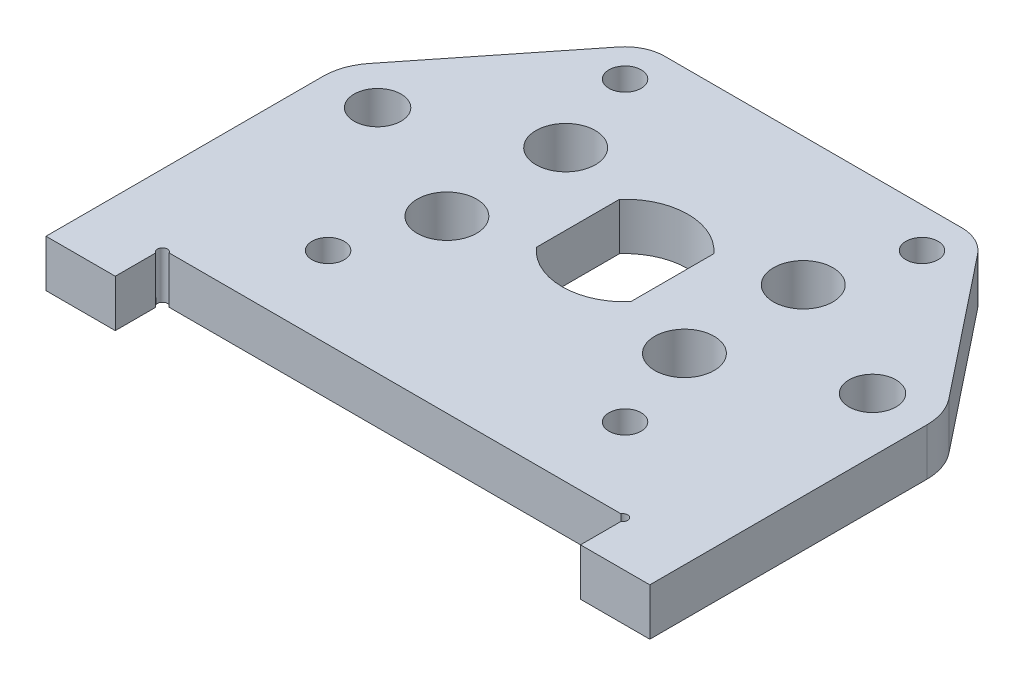
ISO-10303-21;
HEADER;
FILE_DESCRIPTION(('STEP AP214'),'2;1');
FILE_NAME('part.step','',(''),(''),'','','');
FILE_SCHEMA(('AUTOMOTIVE_DESIGN { 1 0 10303 214 1 1 1 1 }'));
ENDSEC;
DATA;
#1=APPLICATION_CONTEXT('core data for automotive mechanical design processes');
#2=APPLICATION_PROTOCOL_DEFINITION('international standard','automotive_design',2000,#1);
#3=PRODUCT_CONTEXT('',#1,'mechanical');
#4=PRODUCT('Part','Part','',(#3));
#5=PRODUCT_RELATED_PRODUCT_CATEGORY('part','',(#4));
#6=PRODUCT_DEFINITION_FORMATION('','',#4);
#7=PRODUCT_DEFINITION_CONTEXT('part definition',#1,'design');
#8=PRODUCT_DEFINITION('design','',#6,#7);
#9=PRODUCT_DEFINITION_SHAPE('','',#8);
#10=(LENGTH_UNIT() NAMED_UNIT(*) SI_UNIT(.MILLI.,.METRE.));
#11=(NAMED_UNIT(*) PLANE_ANGLE_UNIT() SI_UNIT($,.RADIAN.));
#12=(NAMED_UNIT(*) SI_UNIT($,.STERADIAN.) SOLID_ANGLE_UNIT());
#13=UNCERTAINTY_MEASURE_WITH_UNIT(LENGTH_MEASURE(1.E-05),#10,'distance_accuracy_value','');
#14=(GEOMETRIC_REPRESENTATION_CONTEXT(3) GLOBAL_UNCERTAINTY_ASSIGNED_CONTEXT((#13)) GLOBAL_UNIT_ASSIGNED_CONTEXT((#10,
#11,#12)) REPRESENTATION_CONTEXT('',''));
#15=CARTESIAN_POINT('',(0.,0.,0.));
#16=DIRECTION('',(0.,0.,1.));
#17=DIRECTION('',(1.,0.,0.));
#18=AXIS2_PLACEMENT_3D('',#15,#16,#17);
#19=CARTESIAN_POINT('',(-15.0000000000001,4.7625,-15.));
#20=DIRECTION('',(0.,1.,0.));
#21=DIRECTION('',(0.,0.,1.));
#22=AXIS2_PLACEMENT_3D('',#19,#20,#21);
#23=PLANE('',#22);
#24=CARTESIAN_POINT('',(23.25,4.7625,23.4875));
#25=DIRECTION('',(0.,1.,0.));
#26=DIRECTION('',(0.,0.,1.));
#27=AXIS2_PLACEMENT_3D('',#24,#25,#26);
#28=CIRCLE('',#27,0.499999999999999);
#29=CARTESIAN_POINT('',(23.5,4.7625,23.9205127018922));
#30=VERTEX_POINT('',#29);
#31=CARTESIAN_POINT('',(22.8169872981078,4.7625,23.2375));
#32=VERTEX_POINT('',#31);
#33=EDGE_CURVE('E166',#30,#32,#28,.T.);
#34=ORIENTED_EDGE('',*,*,#33,.F.);
#35=DIRECTION('',(0.,0.,-1.));
#36=VECTOR('',#35,1.);
#37=CARTESIAN_POINT('',(23.5,4.7625,28.));
#38=LINE('',#37,#36);
#39=CARTESIAN_POINT('',(23.5,4.7625,28.));
#40=VERTEX_POINT('',#39);
#41=EDGE_CURVE('E177',#40,#30,#38,.T.);
#42=ORIENTED_EDGE('',*,*,#41,.F.);
#43=DIRECTION('',(-1.,0.,0.));
#44=VECTOR('',#43,1.);
#45=CARTESIAN_POINT('',(23.5,4.7625,28.));
#46=LINE('',#45,#44);
#47=CARTESIAN_POINT('',(30.5,4.7625,28.));
#48=VERTEX_POINT('',#47);
#49=EDGE_CURVE('E185',#48,#40,#46,.T.);
#50=ORIENTED_EDGE('',*,*,#49,.F.);
#51=DIRECTION('',(0.,0.,1.));
#52=VECTOR('',#51,1.);
#53=CARTESIAN_POINT('',(30.5,4.7625,0.));
#54=LINE('',#53,#52);
#55=CARTESIAN_POINT('',(30.5,4.7625,0.));
#56=VERTEX_POINT('',#55);
#57=EDGE_CURVE('E188',#56,#48,#54,.T.);
#58=ORIENTED_EDGE('',*,*,#57,.F.);
#59=CARTESIAN_POINT('',(25.,4.7625,0.));
#60=DIRECTION('',(0.,-1.,0.));
#61=DIRECTION('',(0.,0.,-1.));
#62=AXIS2_PLACEMENT_3D('',#59,#60,#61);
#63=CIRCLE('',#62,5.5);
#64=CARTESIAN_POINT('',(29.3065619951255,4.7625,-3.42104133008366));
#65=VERTEX_POINT('',#64);
#66=EDGE_CURVE('E197',#65,#56,#63,.T.);
#67=ORIENTED_EDGE('',*,*,#66,.F.);
#68=DIRECTION('',(0.622007514560665,0.,0.783011271841002));
#69=VECTOR('',#68,1.);
#70=CARTESIAN_POINT('',(29.3065619951255,4.7625,-3.42104133008366));
#71=LINE('',#70,#69);
#72=CARTESIAN_POINT('',(18.1320450873641,4.7625,-17.4880300582427));
#73=VERTEX_POINT('',#72);
#74=EDGE_CURVE('E200',#73,#65,#71,.T.);
#75=ORIENTED_EDGE('',*,*,#74,.F.);
#76=CARTESIAN_POINT('',(15.0000000000001,4.7625,-15.));
#77=DIRECTION('',(0.,-1.,0.));
#78=DIRECTION('',(0.,0.,1.));
#79=AXIS2_PLACEMENT_3D('',#76,#77,#78);
#80=CIRCLE('',#79,4.);
#81=CARTESIAN_POINT('',(15.0000000000001,4.7625,-19.));
#82=VERTEX_POINT('',#81);
#83=EDGE_CURVE('E203',#82,#73,#80,.T.);
#84=ORIENTED_EDGE('',*,*,#83,.F.);
#85=DIRECTION('',(-1.,0.,0.));
#86=VECTOR('',#85,1.);
#87=CARTESIAN_POINT('',(0.,4.7625,-19.));
#88=LINE('',#87,#86);
#89=CARTESIAN_POINT('',(-15.0000000000001,4.7625,-19.));
#90=VERTEX_POINT('',#89);
#91=EDGE_CURVE('E275',#82,#90,#88,.T.);
#92=ORIENTED_EDGE('',*,*,#91,.T.);
#93=CARTESIAN_POINT('',(-15.0000000000001,4.7625,-15.));
#94=DIRECTION('',(0.,1.,0.));
#95=DIRECTION('',(0.,0.,1.));
#96=AXIS2_PLACEMENT_3D('',#93,#94,#95);
#97=CIRCLE('',#96,4.);
#98=CARTESIAN_POINT('',(-18.1320450873641,4.7625,-17.4880300582427));
#99=VERTEX_POINT('',#98);
#100=EDGE_CURVE('E277',#90,#99,#97,.T.);
#101=ORIENTED_EDGE('',*,*,#100,.T.);
#102=DIRECTION('',(-0.622007514560665,0.,0.783011271841002));
#103=VECTOR('',#102,1.);
#104=CARTESIAN_POINT('',(-29.3065619951255,4.7625,-3.42104133008365));
#105=LINE('',#104,#103);
#106=CARTESIAN_POINT('',(-29.3065619951255,4.7625,-3.42104133008365));
#107=VERTEX_POINT('',#106);
#108=EDGE_CURVE('E280',#99,#107,#105,.T.);
#109=ORIENTED_EDGE('',*,*,#108,.T.);
#110=CARTESIAN_POINT('',(-25.,4.7625,0.));
#111=DIRECTION('',(0.,1.,0.));
#112=DIRECTION('',(0.,0.,-1.));
#113=AXIS2_PLACEMENT_3D('',#110,#111,#112);
#114=CIRCLE('',#113,5.5);
#115=CARTESIAN_POINT('',(-30.5,4.7625,0.));
#116=VERTEX_POINT('',#115);
#117=EDGE_CURVE('E282',#107,#116,#114,.T.);
#118=ORIENTED_EDGE('',*,*,#117,.T.);
#119=DIRECTION('',(0.,0.,1.));
#120=VECTOR('',#119,1.);
#121=CARTESIAN_POINT('',(-30.5,4.7625,0.));
#122=LINE('',#121,#120);
#123=CARTESIAN_POINT('',(-30.5,4.7625,28.));
#124=VERTEX_POINT('',#123);
#125=EDGE_CURVE('E284',#116,#124,#122,.T.);
#126=ORIENTED_EDGE('',*,*,#125,.T.);
#127=DIRECTION('',(1.,0.,0.));
#128=VECTOR('',#127,1.);
#129=CARTESIAN_POINT('',(-23.5,4.7625,28.));
#130=LINE('',#129,#128);
#131=CARTESIAN_POINT('',(-23.5,4.7625,28.));
#132=VERTEX_POINT('',#131);
#133=EDGE_CURVE('E286',#124,#132,#130,.T.);
#134=ORIENTED_EDGE('',*,*,#133,.T.);
#135=DIRECTION('',(0.,0.,-1.));
#136=VECTOR('',#135,1.);
#137=CARTESIAN_POINT('',(-23.5,4.7625,28.));
#138=LINE('',#137,#136);
#139=CARTESIAN_POINT('',(-23.5,4.7625,23.9205127018922));
#140=VERTEX_POINT('',#139);
#141=EDGE_CURVE('E288',#132,#140,#138,.T.);
#142=ORIENTED_EDGE('',*,*,#141,.T.);
#143=CARTESIAN_POINT('',(-23.25,4.7625,23.4875));
#144=DIRECTION('',(0.,1.,0.));
#145=DIRECTION('',(0.,0.,1.));
#146=AXIS2_PLACEMENT_3D('',#143,#144,#145);
#147=CIRCLE('',#146,0.499999999999999);
#148=CARTESIAN_POINT('',(-22.8169872981078,4.7625,23.2375));
#149=VERTEX_POINT('',#148);
#150=EDGE_CURVE('E352',#149,#140,#147,.T.);
#151=ORIENTED_EDGE('',*,*,#150,.F.);
#152=DIRECTION('',(1.,0.,0.));
#153=VECTOR('',#152,1.);
#154=CARTESIAN_POINT('',(0.,4.7625,23.2375));
#155=LINE('',#154,#153);
#156=EDGE_CURVE('E181',#149,#32,#155,.T.);
#157=ORIENTED_EDGE('',*,*,#156,.T.);
#158=EDGE_LOOP('',(#34,#42,#50,#58,#67,#75,#84,#92,#101,#109,#118,#126,#134,#142,#151,#157));
#159=FACE_BOUND('',#158,.T.);
#160=CARTESIAN_POINT('',(-25.,4.7625,0.));
#161=DIRECTION('',(0.,1.,0.));
#162=DIRECTION('',(0.,0.,1.));
#163=AXIS2_PLACEMENT_3D('',#160,#161,#162);
#164=CIRCLE('',#163,2.375);
#165=CARTESIAN_POINT('',(-25.,4.7625,2.375));
#166=VERTEX_POINT('',#165);
#167=EDGE_CURVE('E251',#166,#166,#164,.T.);
#168=ORIENTED_EDGE('',*,*,#167,.F.);
#169=EDGE_LOOP('',(#168));
#170=FACE_BOUND('',#169,.T.);
#171=CARTESIAN_POINT('',(-15.0000000000001,4.7625,-15.));
#172=DIRECTION('',(0.,1.,0.));
#173=DIRECTION('',(0.,0.,1.));
#174=AXIS2_PLACEMENT_3D('',#171,#172,#173);
#175=CIRCLE('',#174,1.62500000000002);
#176=CARTESIAN_POINT('',(-15.0000000000001,4.7625,-13.375));
#177=VERTEX_POINT('',#176);
#178=EDGE_CURVE('E263',#177,#177,#175,.T.);
#179=ORIENTED_EDGE('',*,*,#178,.F.);
#180=EDGE_LOOP('',(#179));
#181=FACE_BOUND('',#180,.T.);
#182=CARTESIAN_POINT('',(0.,4.7625,0.));
#183=DIRECTION('',(0.,-1.,0.));
#184=DIRECTION('',(0.,0.,1.));
#185=AXIS2_PLACEMENT_3D('',#182,#183,#184);
#186=CIRCLE('',#185,6.35);
#187=CARTESIAN_POINT('',(-4.7625,4.7625,-4.20013020631504));
#188=VERTEX_POINT('',#187);
#189=CARTESIAN_POINT('',(4.7625,4.7625,-4.20013020631504));
#190=VERTEX_POINT('',#189);
#191=EDGE_CURVE('E296',#188,#190,#186,.T.);
#192=ORIENTED_EDGE('',*,*,#191,.T.);
#193=DIRECTION('',(0.,0.,-1.));
#194=VECTOR('',#193,1.);
#195=CARTESIAN_POINT('',(4.7625,4.7625,4.20013020631504));
#196=LINE('',#195,#194);
#197=CARTESIAN_POINT('',(4.7625,4.7625,4.20013020631503));
#198=VERTEX_POINT('',#197);
#199=EDGE_CURVE('E186',#198,#190,#196,.T.);
#200=ORIENTED_EDGE('',*,*,#199,.F.);
#201=CARTESIAN_POINT('',(0.,4.7625,0.));
#202=DIRECTION('',(0.,-1.,0.));
#203=DIRECTION('',(0.,0.,1.));
#204=AXIS2_PLACEMENT_3D('',#201,#202,#203);
#205=CIRCLE('',#204,6.35);
#206=CARTESIAN_POINT('',(-4.7625,4.7625,4.20013020631503));
#207=VERTEX_POINT('',#206);
#208=EDGE_CURVE('E292',#198,#207,#205,.T.);
#209=ORIENTED_EDGE('',*,*,#208,.T.);
#210=DIRECTION('',(0.,0.,-1.));
#211=VECTOR('',#210,1.);
#212=CARTESIAN_POINT('',(-4.7625,4.7625,4.20013020631504));
#213=LINE('',#212,#211);
#214=EDGE_CURVE('E294',#207,#188,#213,.T.);
#215=ORIENTED_EDGE('',*,*,#214,.T.);
#216=EDGE_LOOP('',(#192,#200,#209,#215));
#217=FACE_BOUND('',#216,.T.);
#218=CARTESIAN_POINT('',(-12.,4.7625,6.));
#219=DIRECTION('',(0.,1.,0.));
#220=DIRECTION('',(0.,0.,1.));
#221=AXIS2_PLACEMENT_3D('',#218,#219,#220);
#222=CIRCLE('',#221,3.);
#223=CARTESIAN_POINT('',(-12.,4.7625,9.));
#224=VERTEX_POINT('',#223);
#225=EDGE_CURVE('E269',#224,#224,#222,.T.);
#226=ORIENTED_EDGE('',*,*,#225,.F.);
#227=EDGE_LOOP('',(#226));
#228=FACE_BOUND('',#227,.T.);
#229=CARTESIAN_POINT('',(-15.,4.7625,15.0000000000001));
#230=DIRECTION('',(0.,1.,0.));
#231=DIRECTION('',(0.,0.,1.));
#232=AXIS2_PLACEMENT_3D('',#229,#230,#231);
#233=CIRCLE('',#232,1.62500000000001);
#234=CARTESIAN_POINT('',(-15.,4.7625,16.6250000000001));
#235=VERTEX_POINT('',#234);
#236=EDGE_CURVE('E257',#235,#235,#233,.T.);
#237=ORIENTED_EDGE('',*,*,#236,.F.);
#238=EDGE_LOOP('',(#237));
#239=FACE_BOUND('',#238,.T.);
#240=CARTESIAN_POINT('',(-12.,4.7625,-6.));
#241=DIRECTION('',(0.,1.,0.));
#242=DIRECTION('',(0.,0.,1.));
#243=AXIS2_PLACEMENT_3D('',#240,#241,#242);
#244=CIRCLE('',#243,3.);
#245=CARTESIAN_POINT('',(-12.,4.7625,-3.));
#246=VERTEX_POINT('',#245);
#247=EDGE_CURVE('E245',#246,#246,#244,.T.);
#248=ORIENTED_EDGE('',*,*,#247,.F.);
#249=EDGE_LOOP('',(#248));
#250=FACE_BOUND('',#249,.T.);
#251=CARTESIAN_POINT('',(12.,4.7625,-6.));
#252=DIRECTION('',(0.,-1.,0.));
#253=DIRECTION('',(0.,0.,1.));
#254=AXIS2_PLACEMENT_3D('',#251,#252,#253);
#255=CIRCLE('',#254,3.);
#256=CARTESIAN_POINT('',(12.,4.7625,-3.));
#257=VERTEX_POINT('',#256);
#258=EDGE_CURVE('E361',#257,#257,#255,.T.);
#259=ORIENTED_EDGE('',*,*,#258,.T.);
#260=EDGE_LOOP('',(#259));
#261=FACE_BOUND('',#260,.T.);
#262=CARTESIAN_POINT('',(25.,4.7625,0.));
#263=DIRECTION('',(0.,-1.,0.));
#264=DIRECTION('',(0.,0.,1.));
#265=AXIS2_PLACEMENT_3D('',#262,#263,#264);
#266=CIRCLE('',#265,2.375);
#267=CARTESIAN_POINT('',(25.,4.7625,2.37499999999999));
#268=VERTEX_POINT('',#267);
#269=EDGE_CURVE('E367',#268,#268,#266,.T.);
#270=ORIENTED_EDGE('',*,*,#269,.T.);
#271=EDGE_LOOP('',(#270));
#272=FACE_BOUND('',#271,.T.);
#273=CARTESIAN_POINT('',(15.,4.7625,15.0000000000001));
#274=DIRECTION('',(0.,-1.,0.));
#275=DIRECTION('',(0.,0.,1.));
#276=AXIS2_PLACEMENT_3D('',#273,#274,#275);
#277=CIRCLE('',#276,1.62500000000001);
#278=CARTESIAN_POINT('',(15.,4.7625,16.6250000000001));
#279=VERTEX_POINT('',#278);
#280=EDGE_CURVE('E373',#279,#279,#277,.T.);
#281=ORIENTED_EDGE('',*,*,#280,.T.);
#282=EDGE_LOOP('',(#281));
#283=FACE_BOUND('',#282,.T.);
#284=CARTESIAN_POINT('',(15.0000000000001,4.7625,-15.));
#285=DIRECTION('',(0.,-1.,0.));
#286=DIRECTION('',(0.,0.,1.));
#287=AXIS2_PLACEMENT_3D('',#284,#285,#286);
#288=CIRCLE('',#287,1.62500000000002);
#289=CARTESIAN_POINT('',(15.0000000000001,4.7625,-13.375));
#290=VERTEX_POINT('',#289);
#291=EDGE_CURVE('E379',#290,#290,#288,.T.);
#292=ORIENTED_EDGE('',*,*,#291,.T.);
#293=EDGE_LOOP('',(#292));
#294=FACE_BOUND('',#293,.T.);
#295=CARTESIAN_POINT('',(12.,4.7625,6.));
#296=DIRECTION('',(0.,-1.,0.));
#297=DIRECTION('',(0.,0.,1.));
#298=AXIS2_PLACEMENT_3D('',#295,#296,#297);
#299=CIRCLE('',#298,3.);
#300=CARTESIAN_POINT('',(12.,4.7625,9.));
#301=VERTEX_POINT('',#300);
#302=EDGE_CURVE('E211',#301,#301,#299,.T.);
#303=ORIENTED_EDGE('',*,*,#302,.T.);
#304=EDGE_LOOP('',(#303));
#305=FACE_BOUND('',#304,.T.);
#306=ADVANCED_FACE('F31',(#159,#170,#181,#217,#228,#239,#250,#261,#272,#283,#294,#305),#23,.T.);
#307=CARTESIAN_POINT('',(-15.0000000000001,0.,-15.));
#308=DIRECTION('',(0.,1.,0.));
#309=DIRECTION('',(0.,0.,1.));
#310=AXIS2_PLACEMENT_3D('',#307,#308,#309);
#311=PLANE('',#310);
#312=DIRECTION('',(0.,0.,-1.));
#313=VECTOR('',#312,1.);
#314=CARTESIAN_POINT('',(23.5,0.,28.));
#315=LINE('',#314,#313);
#316=CARTESIAN_POINT('',(23.5,0.,28.));
#317=VERTEX_POINT('',#316);
#318=CARTESIAN_POINT('',(23.5,0.,23.9205127018922));
#319=VERTEX_POINT('',#318);
#320=EDGE_CURVE('E210',#317,#319,#315,.T.);
#321=ORIENTED_EDGE('',*,*,#320,.T.);
#322=CARTESIAN_POINT('',(23.25,0.,23.4875));
#323=DIRECTION('',(0.,1.,0.));
#324=DIRECTION('',(0.,0.,1.));
#325=AXIS2_PLACEMENT_3D('',#322,#323,#324);
#326=CIRCLE('',#325,0.499999999999999);
#327=CARTESIAN_POINT('',(22.8169872981078,0.,23.2375));
#328=VERTEX_POINT('',#327);
#329=EDGE_CURVE('E45',#319,#328,#326,.T.);
#330=ORIENTED_EDGE('',*,*,#329,.T.);
#331=DIRECTION('',(1.,0.,0.));
#332=VECTOR('',#331,1.);
#333=CARTESIAN_POINT('',(0.,0.,23.2375));
#334=LINE('',#333,#332);
#335=CARTESIAN_POINT('',(-22.8169872981078,0.,23.2375));
#336=VERTEX_POINT('',#335);
#337=EDGE_CURVE('E313',#336,#328,#334,.T.);
#338=ORIENTED_EDGE('',*,*,#337,.F.);
#339=CARTESIAN_POINT('',(-23.25,0.,23.4875));
#340=DIRECTION('',(0.,1.,0.));
#341=DIRECTION('',(0.,0.,1.));
#342=AXIS2_PLACEMENT_3D('',#339,#340,#341);
#343=CIRCLE('',#342,0.499999999999999);
#344=CARTESIAN_POINT('',(-23.5,0.,23.9205127018922));
#345=VERTEX_POINT('',#344);
#346=EDGE_CURVE('E53',#336,#345,#343,.T.);
#347=ORIENTED_EDGE('',*,*,#346,.T.);
#348=DIRECTION('',(0.,0.,-1.));
#349=VECTOR('',#348,1.);
#350=CARTESIAN_POINT('',(-23.5,0.,28.));
#351=LINE('',#350,#349);
#352=CARTESIAN_POINT('',(-23.5,0.,28.));
#353=VERTEX_POINT('',#352);
#354=EDGE_CURVE('E310',#353,#345,#351,.T.);
#355=ORIENTED_EDGE('',*,*,#354,.F.);
#356=DIRECTION('',(1.,0.,0.));
#357=VECTOR('',#356,1.);
#358=CARTESIAN_POINT('',(-23.5,0.,28.));
#359=LINE('',#358,#357);
#360=CARTESIAN_POINT('',(-30.5,0.,28.));
#361=VERTEX_POINT('',#360);
#362=EDGE_CURVE('E308',#361,#353,#359,.T.);
#363=ORIENTED_EDGE('',*,*,#362,.F.);
#364=DIRECTION('',(0.,0.,1.));
#365=VECTOR('',#364,1.);
#366=CARTESIAN_POINT('',(-30.5,0.,0.));
#367=LINE('',#366,#365);
#368=CARTESIAN_POINT('',(-30.5,0.,0.));
#369=VERTEX_POINT('',#368);
#370=EDGE_CURVE('E306',#369,#361,#367,.T.);
#371=ORIENTED_EDGE('',*,*,#370,.F.);
#372=CARTESIAN_POINT('',(-25.,0.,0.));
#373=DIRECTION('',(0.,1.,0.));
#374=DIRECTION('',(0.,0.,-1.));
#375=AXIS2_PLACEMENT_3D('',#372,#373,#374);
#376=CIRCLE('',#375,5.5);
#377=CARTESIAN_POINT('',(-29.3065619951255,0.,-3.42104133008365));
#378=VERTEX_POINT('',#377);
#379=EDGE_CURVE('E304',#378,#369,#376,.T.);
#380=ORIENTED_EDGE('',*,*,#379,.F.);
#381=DIRECTION('',(-0.622007514560665,0.,0.783011271841002));
#382=VECTOR('',#381,1.);
#383=CARTESIAN_POINT('',(-29.3065619951255,0.,-3.42104133008365));
#384=LINE('',#383,#382);
#385=CARTESIAN_POINT('',(-18.1320450873641,0.,-17.4880300582427));
#386=VERTEX_POINT('',#385);
#387=EDGE_CURVE('E302',#386,#378,#384,.T.);
#388=ORIENTED_EDGE('',*,*,#387,.F.);
#389=CARTESIAN_POINT('',(-15.0000000000001,0.,-15.));
#390=DIRECTION('',(0.,1.,0.));
#391=DIRECTION('',(0.,0.,1.));
#392=AXIS2_PLACEMENT_3D('',#389,#390,#391);
#393=CIRCLE('',#392,4.);
#394=CARTESIAN_POINT('',(-15.0000000000001,0.,-19.));
#395=VERTEX_POINT('',#394);
#396=EDGE_CURVE('E300',#395,#386,#393,.T.);
#397=ORIENTED_EDGE('',*,*,#396,.F.);
#398=DIRECTION('',(-1.,0.,0.));
#399=VECTOR('',#398,1.);
#400=CARTESIAN_POINT('',(0.,0.,-19.));
#401=LINE('',#400,#399);
#402=CARTESIAN_POINT('',(15.0000000000001,0.,-19.));
#403=VERTEX_POINT('',#402);
#404=EDGE_CURVE('E272',#403,#395,#401,.T.);
#405=ORIENTED_EDGE('',*,*,#404,.F.);
#406=CARTESIAN_POINT('',(15.0000000000001,0.,-15.));
#407=DIRECTION('',(0.,-1.,0.));
#408=DIRECTION('',(0.,0.,1.));
#409=AXIS2_PLACEMENT_3D('',#406,#407,#408);
#410=CIRCLE('',#409,4.);
#411=CARTESIAN_POINT('',(18.1320450873641,0.,-17.4880300582427));
#412=VERTEX_POINT('',#411);
#413=EDGE_CURVE('E191',#403,#412,#410,.T.);
#414=ORIENTED_EDGE('',*,*,#413,.T.);
#415=DIRECTION('',(0.622007514560665,0.,0.783011271841002));
#416=VECTOR('',#415,1.);
#417=CARTESIAN_POINT('',(29.3065619951255,0.,-3.42104133008366));
#418=LINE('',#417,#416);
#419=CARTESIAN_POINT('',(29.3065619951255,0.,-3.42104133008366));
#420=VERTEX_POINT('',#419);
#421=EDGE_CURVE('E222',#412,#420,#418,.T.);
#422=ORIENTED_EDGE('',*,*,#421,.T.);
#423=CARTESIAN_POINT('',(25.,0.,0.));
#424=DIRECTION('',(0.,-1.,0.));
#425=DIRECTION('',(0.,0.,-1.));
#426=AXIS2_PLACEMENT_3D('',#423,#424,#425);
#427=CIRCLE('',#426,5.5);
#428=CARTESIAN_POINT('',(30.5,0.,0.));
#429=VERTEX_POINT('',#428);
#430=EDGE_CURVE('E219',#420,#429,#427,.T.);
#431=ORIENTED_EDGE('',*,*,#430,.T.);
#432=DIRECTION('',(0.,0.,1.));
#433=VECTOR('',#432,1.);
#434=CARTESIAN_POINT('',(30.5,0.,0.));
#435=LINE('',#434,#433);
#436=CARTESIAN_POINT('',(30.5,0.,28.));
#437=VERTEX_POINT('',#436);
#438=EDGE_CURVE('E216',#429,#437,#435,.T.);
#439=ORIENTED_EDGE('',*,*,#438,.T.);
#440=DIRECTION('',(-1.,0.,0.));
#441=VECTOR('',#440,1.);
#442=CARTESIAN_POINT('',(23.5,0.,28.));
#443=LINE('',#442,#441);
#444=EDGE_CURVE('E213',#437,#317,#443,.T.);
#445=ORIENTED_EDGE('',*,*,#444,.T.);
#446=EDGE_LOOP('',(#321,#330,#338,#347,#355,#363,#371,#380,#388,#397,#405,#414,#422,#431,#439,#445));
#447=FACE_BOUND('',#446,.T.);
#448=CARTESIAN_POINT('',(-25.,0.,0.));
#449=DIRECTION('',(0.,1.,0.));
#450=DIRECTION('',(0.,0.,1.));
#451=AXIS2_PLACEMENT_3D('',#448,#449,#450);
#452=CIRCLE('',#451,2.375);
#453=CARTESIAN_POINT('',(-25.,0.,2.375));
#454=VERTEX_POINT('',#453);
#455=EDGE_CURVE('E248',#454,#454,#452,.T.);
#456=ORIENTED_EDGE('',*,*,#455,.T.);
#457=EDGE_LOOP('',(#456));
#458=FACE_BOUND('',#457,.T.);
#459=CARTESIAN_POINT('',(-15.0000000000001,0.,-15.));
#460=DIRECTION('',(0.,1.,0.));
#461=DIRECTION('',(0.,0.,1.));
#462=AXIS2_PLACEMENT_3D('',#459,#460,#461);
#463=CIRCLE('',#462,1.62500000000002);
#464=CARTESIAN_POINT('',(-15.0000000000001,0.,-13.375));
#465=VERTEX_POINT('',#464);
#466=EDGE_CURVE('E260',#465,#465,#463,.T.);
#467=ORIENTED_EDGE('',*,*,#466,.T.);
#468=EDGE_LOOP('',(#467));
#469=FACE_BOUND('',#468,.T.);
#470=DIRECTION('',(0.,0.,-1.));
#471=VECTOR('',#470,1.);
#472=CARTESIAN_POINT('',(4.7625,0.,4.20013020631504));
#473=LINE('',#472,#471);
#474=CARTESIAN_POINT('',(4.7625,0.,4.20013020631503));
#475=VERTEX_POINT('',#474);
#476=CARTESIAN_POINT('',(4.7625,0.,-4.20013020631504));
#477=VERTEX_POINT('',#476);
#478=EDGE_CURVE('E207',#475,#477,#473,.T.);
#479=ORIENTED_EDGE('',*,*,#478,.T.);
#480=CARTESIAN_POINT('',(0.,0.,0.));
#481=DIRECTION('',(0.,-1.,0.));
#482=DIRECTION('',(0.,0.,1.));
#483=AXIS2_PLACEMENT_3D('',#480,#481,#482);
#484=CIRCLE('',#483,6.35);
#485=CARTESIAN_POINT('',(-4.7625,0.,-4.20013020631504));
#486=VERTEX_POINT('',#485);
#487=EDGE_CURVE('E278',#486,#477,#484,.T.);
#488=ORIENTED_EDGE('',*,*,#487,.F.);
#489=DIRECTION('',(0.,0.,-1.));
#490=VECTOR('',#489,1.);
#491=CARTESIAN_POINT('',(-4.7625,0.,4.20013020631504));
#492=LINE('',#491,#490);
#493=CARTESIAN_POINT('',(-4.7625,0.,4.20013020631503));
#494=VERTEX_POINT('',#493);
#495=EDGE_CURVE('E318',#494,#486,#492,.T.);
#496=ORIENTED_EDGE('',*,*,#495,.F.);
#497=CARTESIAN_POINT('',(0.,0.,0.));
#498=DIRECTION('',(0.,-1.,0.));
#499=DIRECTION('',(0.,0.,1.));
#500=AXIS2_PLACEMENT_3D('',#497,#498,#499);
#501=CIRCLE('',#500,6.35);
#502=EDGE_CURVE('E316',#475,#494,#501,.T.);
#503=ORIENTED_EDGE('',*,*,#502,.F.);
#504=EDGE_LOOP('',(#479,#488,#496,#503));
#505=FACE_BOUND('',#504,.T.);
#506=CARTESIAN_POINT('',(-12.,0.,6.));
#507=DIRECTION('',(0.,1.,0.));
#508=DIRECTION('',(0.,0.,1.));
#509=AXIS2_PLACEMENT_3D('',#506,#507,#508);
#510=CIRCLE('',#509,3.);
#511=CARTESIAN_POINT('',(-12.,0.,9.));
#512=VERTEX_POINT('',#511);
#513=EDGE_CURVE('E266',#512,#512,#510,.T.);
#514=ORIENTED_EDGE('',*,*,#513,.T.);
#515=EDGE_LOOP('',(#514));
#516=FACE_BOUND('',#515,.T.);
#517=CARTESIAN_POINT('',(-15.,0.,15.0000000000001));
#518=DIRECTION('',(0.,1.,0.));
#519=DIRECTION('',(0.,0.,1.));
#520=AXIS2_PLACEMENT_3D('',#517,#518,#519);
#521=CIRCLE('',#520,1.62500000000001);
#522=CARTESIAN_POINT('',(-15.,0.,16.6250000000001));
#523=VERTEX_POINT('',#522);
#524=EDGE_CURVE('E254',#523,#523,#521,.T.);
#525=ORIENTED_EDGE('',*,*,#524,.T.);
#526=EDGE_LOOP('',(#525));
#527=FACE_BOUND('',#526,.T.);
#528=CARTESIAN_POINT('',(-12.,0.,-6.));
#529=DIRECTION('',(0.,1.,0.));
#530=DIRECTION('',(0.,0.,1.));
#531=AXIS2_PLACEMENT_3D('',#528,#529,#530);
#532=CIRCLE('',#531,3.);
#533=CARTESIAN_POINT('',(-12.,0.,-3.));
#534=VERTEX_POINT('',#533);
#535=EDGE_CURVE('E244',#534,#534,#532,.T.);
#536=ORIENTED_EDGE('',*,*,#535,.T.);
#537=EDGE_LOOP('',(#536));
#538=FACE_BOUND('',#537,.T.);
#539=CARTESIAN_POINT('',(12.,0.,-6.));
#540=DIRECTION('',(0.,-1.,0.));
#541=DIRECTION('',(0.,0.,1.));
#542=AXIS2_PLACEMENT_3D('',#539,#540,#541);
#543=CIRCLE('',#542,3.);
#544=CARTESIAN_POINT('',(12.,0.,-3.));
#545=VERTEX_POINT('',#544);
#546=EDGE_CURVE('E360',#545,#545,#543,.T.);
#547=ORIENTED_EDGE('',*,*,#546,.F.);
#548=EDGE_LOOP('',(#547));
#549=FACE_BOUND('',#548,.T.);
#550=CARTESIAN_POINT('',(25.,0.,0.));
#551=DIRECTION('',(0.,-1.,0.));
#552=DIRECTION('',(0.,0.,1.));
#553=AXIS2_PLACEMENT_3D('',#550,#551,#552);
#554=CIRCLE('',#553,2.375);
#555=CARTESIAN_POINT('',(25.,0.,2.37499999999999));
#556=VERTEX_POINT('',#555);
#557=EDGE_CURVE('E364',#556,#556,#554,.T.);
#558=ORIENTED_EDGE('',*,*,#557,.F.);
#559=EDGE_LOOP('',(#558));
#560=FACE_BOUND('',#559,.T.);
#561=CARTESIAN_POINT('',(15.,0.,15.0000000000001));
#562=DIRECTION('',(0.,-1.,0.));
#563=DIRECTION('',(0.,0.,1.));
#564=AXIS2_PLACEMENT_3D('',#561,#562,#563);
#565=CIRCLE('',#564,1.62500000000001);
#566=CARTESIAN_POINT('',(15.,0.,16.6250000000001));
#567=VERTEX_POINT('',#566);
#568=EDGE_CURVE('E370',#567,#567,#565,.T.);
#569=ORIENTED_EDGE('',*,*,#568,.F.);
#570=EDGE_LOOP('',(#569));
#571=FACE_BOUND('',#570,.T.);
#572=CARTESIAN_POINT('',(15.0000000000001,0.,-15.));
#573=DIRECTION('',(0.,-1.,0.));
#574=DIRECTION('',(0.,0.,1.));
#575=AXIS2_PLACEMENT_3D('',#572,#573,#574);
#576=CIRCLE('',#575,1.62500000000002);
#577=CARTESIAN_POINT('',(15.0000000000001,0.,-13.375));
#578=VERTEX_POINT('',#577);
#579=EDGE_CURVE('E376',#578,#578,#576,.T.);
#580=ORIENTED_EDGE('',*,*,#579,.F.);
#581=EDGE_LOOP('',(#580));
#582=FACE_BOUND('',#581,.T.);
#583=CARTESIAN_POINT('',(12.,0.,6.));
#584=DIRECTION('',(0.,-1.,0.));
#585=DIRECTION('',(0.,0.,1.));
#586=AXIS2_PLACEMENT_3D('',#583,#584,#585);
#587=CIRCLE('',#586,3.);
#588=CARTESIAN_POINT('',(12.,0.,9.));
#589=VERTEX_POINT('',#588);
#590=EDGE_CURVE('E382',#589,#589,#587,.T.);
#591=ORIENTED_EDGE('',*,*,#590,.F.);
#592=EDGE_LOOP('',(#591));
#593=FACE_BOUND('',#592,.T.);
#594=ADVANCED_FACE('F347',(#447,#458,#469,#505,#516,#527,#538,#549,#560,#571,#582,#593),#311,.F.);
#595=CARTESIAN_POINT('',(0.,4.7625,-19.));
#596=DIRECTION('',(0.,0.,1.));
#597=DIRECTION('',(1.,0.,0.));
#598=AXIS2_PLACEMENT_3D('',#595,#596,#597);
#599=PLANE('',#598);
#600=ORIENTED_EDGE('',*,*,#404,.T.);
#601=DIRECTION('',(0.,-1.,0.));
#602=VECTOR('',#601,1.);
#603=CARTESIAN_POINT('',(-15.0000000000001,4.7625,-19.));
#604=LINE('',#603,#602);
#605=EDGE_CURVE('E341',#90,#395,#604,.T.);
#606=ORIENTED_EDGE('',*,*,#605,.F.);
#607=ORIENTED_EDGE('',*,*,#91,.F.);
#608=DIRECTION('',(0.,-1.,0.));
#609=VECTOR('',#608,1.);
#610=CARTESIAN_POINT('',(15.0000000000001,4.7625,-19.));
#611=LINE('',#610,#609);
#612=EDGE_CURVE('E206',#82,#403,#611,.T.);
#613=ORIENTED_EDGE('',*,*,#612,.T.);
#614=EDGE_LOOP('',(#600,#606,#607,#613));
#615=FACE_BOUND('',#614,.T.);
#616=ADVANCED_FACE('F33',(#615),#599,.F.);
#617=CARTESIAN_POINT('',(-15.0000000000001,4.7625,-15.));
#618=DIRECTION('',(0.,-1.,0.));
#619=DIRECTION('',(0.,0.,-1.));
#620=AXIS2_PLACEMENT_3D('',#617,#618,#619);
#621=CYLINDRICAL_SURFACE('',#620,4.);
#622=ORIENTED_EDGE('',*,*,#396,.T.);
#623=DIRECTION('',(0.,-1.,0.));
#624=VECTOR('',#623,1.);
#625=CARTESIAN_POINT('',(-18.1320450873641,4.7625,-17.4880300582427));
#626=LINE('',#625,#624);
#627=EDGE_CURVE('E338',#99,#386,#626,.T.);
#628=ORIENTED_EDGE('',*,*,#627,.F.);
#629=ORIENTED_EDGE('',*,*,#100,.F.);
#630=ORIENTED_EDGE('',*,*,#605,.T.);
#631=EDGE_LOOP('',(#622,#628,#629,#630));
#632=FACE_BOUND('',#631,.T.);
#633=ADVANCED_FACE('F397',(#632),#621,.T.);
#634=CARTESIAN_POINT('',(-29.3065619951255,4.7625,-3.42104133008365));
#635=DIRECTION('',(0.783011271841002,0.,0.622007514560665));
#636=DIRECTION('',(0.622007514560665,0.,-0.783011271841002));
#637=AXIS2_PLACEMENT_3D('',#634,#635,#636);
#638=PLANE('',#637);
#639=ORIENTED_EDGE('',*,*,#387,.T.);
#640=DIRECTION('',(0.,-1.,0.));
#641=VECTOR('',#640,1.);
#642=CARTESIAN_POINT('',(-29.3065619951255,4.7625,-3.42104133008365));
#643=LINE('',#642,#641);
#644=EDGE_CURVE('E335',#107,#378,#643,.T.);
#645=ORIENTED_EDGE('',*,*,#644,.F.);
#646=ORIENTED_EDGE('',*,*,#108,.F.);
#647=ORIENTED_EDGE('',*,*,#627,.T.);
#648=EDGE_LOOP('',(#639,#645,#646,#647));
#649=FACE_BOUND('',#648,.T.);
#650=ADVANCED_FACE('F432',(#649),#638,.F.);
#651=CARTESIAN_POINT('',(-25.,4.7625,0.));
#652=DIRECTION('',(0.,-1.,0.));
#653=DIRECTION('',(0.,0.,-1.));
#654=AXIS2_PLACEMENT_3D('',#651,#652,#653);
#655=CYLINDRICAL_SURFACE('',#654,5.5);
#656=ORIENTED_EDGE('',*,*,#379,.T.);
#657=DIRECTION('',(0.,-1.,0.));
#658=VECTOR('',#657,1.);
#659=CARTESIAN_POINT('',(-30.5,4.7625,0.));
#660=LINE('',#659,#658);
#661=EDGE_CURVE('E332',#116,#369,#660,.T.);
#662=ORIENTED_EDGE('',*,*,#661,.F.);
#663=ORIENTED_EDGE('',*,*,#117,.F.);
#664=ORIENTED_EDGE('',*,*,#644,.T.);
#665=EDGE_LOOP('',(#656,#662,#663,#664));
#666=FACE_BOUND('',#665,.T.);
#667=ADVANCED_FACE('F428',(#666),#655,.T.);
#668=CARTESIAN_POINT('',(-30.5,4.7625,0.));
#669=DIRECTION('',(1.,0.,0.));
#670=DIRECTION('',(0.,0.,-1.));
#671=AXIS2_PLACEMENT_3D('',#668,#669,#670);
#672=PLANE('',#671);
#673=ORIENTED_EDGE('',*,*,#370,.T.);
#674=DIRECTION('',(0.,-1.,0.));
#675=VECTOR('',#674,1.);
#676=CARTESIAN_POINT('',(-30.5,4.7625,28.));
#677=LINE('',#676,#675);
#678=EDGE_CURVE('E329',#124,#361,#677,.T.);
#679=ORIENTED_EDGE('',*,*,#678,.F.);
#680=ORIENTED_EDGE('',*,*,#125,.F.);
#681=ORIENTED_EDGE('',*,*,#661,.T.);
#682=EDGE_LOOP('',(#673,#679,#680,#681));
#683=FACE_BOUND('',#682,.T.);
#684=ADVANCED_FACE('F424',(#683),#672,.F.);
#685=CARTESIAN_POINT('',(-23.5,4.7625,28.));
#686=DIRECTION('',(0.,0.,-1.));
#687=DIRECTION('',(-1.,0.,0.));
#688=AXIS2_PLACEMENT_3D('',#685,#686,#687);
#689=PLANE('',#688);
#690=ORIENTED_EDGE('',*,*,#362,.T.);
#691=DIRECTION('',(0.,-1.,0.));
#692=VECTOR('',#691,1.);
#693=CARTESIAN_POINT('',(-23.5,4.7625,28.));
#694=LINE('',#693,#692);
#695=EDGE_CURVE('E326',#132,#353,#694,.T.);
#696=ORIENTED_EDGE('',*,*,#695,.F.);
#697=ORIENTED_EDGE('',*,*,#133,.F.);
#698=ORIENTED_EDGE('',*,*,#678,.T.);
#699=EDGE_LOOP('',(#690,#696,#697,#698));
#700=FACE_BOUND('',#699,.T.);
#701=ADVANCED_FACE('F420',(#700),#689,.F.);
#702=CARTESIAN_POINT('',(-23.5,4.7625,28.));
#703=DIRECTION('',(-1.,0.,0.));
#704=DIRECTION('',(0.,0.,1.));
#705=AXIS2_PLACEMENT_3D('',#702,#703,#704);
#706=PLANE('',#705);
#707=ORIENTED_EDGE('',*,*,#354,.T.);
#708=DIRECTION('',(0.,1.,0.));
#709=VECTOR('',#708,1.);
#710=CARTESIAN_POINT('',(-23.5,0.,23.9205127018922));
#711=LINE('',#710,#709);
#712=EDGE_CURVE('E356',#345,#140,#711,.T.);
#713=ORIENTED_EDGE('',*,*,#712,.T.);
#714=ORIENTED_EDGE('',*,*,#141,.F.);
#715=ORIENTED_EDGE('',*,*,#695,.T.);
#716=EDGE_LOOP('',(#707,#713,#714,#715));
#717=FACE_BOUND('',#716,.T.);
#718=ADVANCED_FACE('F417',(#717),#706,.F.);
#719=CARTESIAN_POINT('',(0.,4.7625,23.2375));
#720=DIRECTION('',(0.,0.,-1.));
#721=DIRECTION('',(-1.,0.,0.));
#722=AXIS2_PLACEMENT_3D('',#719,#720,#721);
#723=PLANE('',#722);
#724=ORIENTED_EDGE('',*,*,#337,.T.);
#725=DIRECTION('',(0.,1.,0.));
#726=VECTOR('',#725,1.);
#727=CARTESIAN_POINT('',(22.8169872981078,0.,23.2375));
#728=LINE('',#727,#726);
#729=EDGE_CURVE('E350',#328,#32,#728,.T.);
#730=ORIENTED_EDGE('',*,*,#729,.T.);
#731=ORIENTED_EDGE('',*,*,#156,.F.);
#732=DIRECTION('',(0.,1.,0.));
#733=VECTOR('',#732,1.);
#734=CARTESIAN_POINT('',(-22.8169872981078,0.,23.2375));
#735=LINE('',#734,#733);
#736=EDGE_CURVE('E39',#149,#336,#735,.F.);
#737=ORIENTED_EDGE('',*,*,#736,.T.);
#738=EDGE_LOOP('',(#724,#730,#731,#737));
#739=FACE_BOUND('',#738,.T.);
#740=ADVANCED_FACE('F345',(#739),#723,.F.);
#741=CARTESIAN_POINT('',(0.,4.7625,0.));
#742=DIRECTION('',(0.,-1.,0.));
#743=DIRECTION('',(0.,0.,-1.));
#744=AXIS2_PLACEMENT_3D('',#741,#742,#743);
#745=CYLINDRICAL_SURFACE('',#744,6.35);
#746=ORIENTED_EDGE('',*,*,#502,.T.);
#747=DIRECTION('',(0.,-1.,0.));
#748=VECTOR('',#747,1.);
#749=CARTESIAN_POINT('',(-4.7625,4.7625,4.20013020631503));
#750=LINE('',#749,#748);
#751=EDGE_CURVE('E323',#207,#494,#750,.T.);
#752=ORIENTED_EDGE('',*,*,#751,.F.);
#753=ORIENTED_EDGE('',*,*,#208,.F.);
#754=DIRECTION('',(0.,-1.,0.));
#755=VECTOR('',#754,1.);
#756=CARTESIAN_POINT('',(4.7625,4.7625,4.20013020631503));
#757=LINE('',#756,#755);
#758=EDGE_CURVE('E238',#198,#475,#757,.T.);
#759=ORIENTED_EDGE('',*,*,#758,.T.);
#760=EDGE_LOOP('',(#746,#752,#753,#759));
#761=FACE_BOUND('',#760,.T.);
#762=ADVANCED_FACE('F410',(#761),#745,.F.);
#763=CARTESIAN_POINT('',(-4.7625,4.7625,4.20013020631504));
#764=DIRECTION('',(-1.,0.,0.));
#765=DIRECTION('',(0.,0.,1.));
#766=AXIS2_PLACEMENT_3D('',#763,#764,#765);
#767=PLANE('',#766);
#768=ORIENTED_EDGE('',*,*,#495,.T.);
#769=DIRECTION('',(0.,-1.,0.));
#770=VECTOR('',#769,1.);
#771=CARTESIAN_POINT('',(-4.7625,4.7625,-4.20013020631504));
#772=LINE('',#771,#770);
#773=EDGE_CURVE('E298',#188,#486,#772,.T.);
#774=ORIENTED_EDGE('',*,*,#773,.F.);
#775=ORIENTED_EDGE('',*,*,#214,.F.);
#776=ORIENTED_EDGE('',*,*,#751,.T.);
#777=EDGE_LOOP('',(#768,#774,#775,#776));
#778=FACE_BOUND('',#777,.T.);
#779=ADVANCED_FACE('F406',(#778),#767,.F.);
#780=CARTESIAN_POINT('',(0.,4.7625,0.));
#781=DIRECTION('',(0.,-1.,0.));
#782=DIRECTION('',(0.,0.,-1.));
#783=AXIS2_PLACEMENT_3D('',#780,#781,#782);
#784=CYLINDRICAL_SURFACE('',#783,6.35);
#785=ORIENTED_EDGE('',*,*,#487,.T.);
#786=DIRECTION('',(0.,-1.,0.));
#787=VECTOR('',#786,1.);
#788=CARTESIAN_POINT('',(4.7625,4.7625,-4.20013020631504));
#789=LINE('',#788,#787);
#790=EDGE_CURVE('E241',#190,#477,#789,.T.);
#791=ORIENTED_EDGE('',*,*,#790,.F.);
#792=ORIENTED_EDGE('',*,*,#191,.F.);
#793=ORIENTED_EDGE('',*,*,#773,.T.);
#794=EDGE_LOOP('',(#785,#791,#792,#793));
#795=FACE_BOUND('',#794,.T.);
#796=ADVANCED_FACE('F402',(#795),#784,.F.);
#797=CARTESIAN_POINT('',(-12.,4.7625,6.));
#798=DIRECTION('',(0.,-1.,0.));
#799=DIRECTION('',(0.,0.,-1.));
#800=AXIS2_PLACEMENT_3D('',#797,#798,#799);
#801=CYLINDRICAL_SURFACE('',#800,3.);
#802=ORIENTED_EDGE('',*,*,#225,.T.);
#803=EDGE_LOOP('',(#802));
#804=FACE_BOUND('',#803,.T.);
#805=ORIENTED_EDGE('',*,*,#513,.F.);
#806=EDGE_LOOP('',(#805));
#807=FACE_BOUND('',#806,.T.);
#808=ADVANCED_FACE('F405',(#804,#807),#801,.F.);
#809=CARTESIAN_POINT('',(-15.0000000000001,4.7625,-15.));
#810=DIRECTION('',(0.,-1.,0.));
#811=DIRECTION('',(0.,0.,-1.));
#812=AXIS2_PLACEMENT_3D('',#809,#810,#811);
#813=CYLINDRICAL_SURFACE('',#812,1.62500000000002);
#814=ORIENTED_EDGE('',*,*,#178,.T.);
#815=EDGE_LOOP('',(#814));
#816=FACE_BOUND('',#815,.T.);
#817=ORIENTED_EDGE('',*,*,#466,.F.);
#818=EDGE_LOOP('',(#817));
#819=FACE_BOUND('',#818,.T.);
#820=ADVANCED_FACE('F501',(#816,#819),#813,.F.);
#821=CARTESIAN_POINT('',(-15.,4.7625,15.0000000000001));
#822=DIRECTION('',(0.,-1.,0.));
#823=DIRECTION('',(0.,0.,-1.));
#824=AXIS2_PLACEMENT_3D('',#821,#822,#823);
#825=CYLINDRICAL_SURFACE('',#824,1.62500000000001);
#826=ORIENTED_EDGE('',*,*,#236,.T.);
#827=EDGE_LOOP('',(#826));
#828=FACE_BOUND('',#827,.T.);
#829=ORIENTED_EDGE('',*,*,#524,.F.);
#830=EDGE_LOOP('',(#829));
#831=FACE_BOUND('',#830,.T.);
#832=ADVANCED_FACE('F497',(#828,#831),#825,.F.);
#833=CARTESIAN_POINT('',(-25.,4.7625,0.));
#834=DIRECTION('',(0.,-1.,0.));
#835=DIRECTION('',(0.,0.,-1.));
#836=AXIS2_PLACEMENT_3D('',#833,#834,#835);
#837=CYLINDRICAL_SURFACE('',#836,2.375);
#838=ORIENTED_EDGE('',*,*,#167,.T.);
#839=EDGE_LOOP('',(#838));
#840=FACE_BOUND('',#839,.T.);
#841=ORIENTED_EDGE('',*,*,#455,.F.);
#842=EDGE_LOOP('',(#841));
#843=FACE_BOUND('',#842,.T.);
#844=ADVANCED_FACE('F493',(#840,#843),#837,.F.);
#845=CARTESIAN_POINT('',(-12.,4.7625,-6.));
#846=DIRECTION('',(0.,-1.,0.));
#847=DIRECTION('',(0.,0.,-1.));
#848=AXIS2_PLACEMENT_3D('',#845,#846,#847);
#849=CYLINDRICAL_SURFACE('',#848,3.);
#850=ORIENTED_EDGE('',*,*,#247,.T.);
#851=EDGE_LOOP('',(#850));
#852=FACE_BOUND('',#851,.T.);
#853=ORIENTED_EDGE('',*,*,#535,.F.);
#854=EDGE_LOOP('',(#853));
#855=FACE_BOUND('',#854,.T.);
#856=ADVANCED_FACE('F489',(#852,#855),#849,.F.);
#857=CARTESIAN_POINT('',(4.7625,4.7625,4.20013020631504));
#858=DIRECTION('',(-1.,0.,0.));
#859=DIRECTION('',(0.,0.,1.));
#860=AXIS2_PLACEMENT_3D('',#857,#858,#859);
#861=PLANE('',#860);
#862=ORIENTED_EDGE('',*,*,#478,.F.);
#863=ORIENTED_EDGE('',*,*,#758,.F.);
#864=ORIENTED_EDGE('',*,*,#199,.T.);
#865=ORIENTED_EDGE('',*,*,#790,.T.);
#866=EDGE_LOOP('',(#862,#863,#864,#865));
#867=FACE_BOUND('',#866,.T.);
#868=ADVANCED_FACE('F483',(#867),#861,.T.);
#869=CARTESIAN_POINT('',(23.5,4.7625,28.));
#870=DIRECTION('',(-1.,0.,0.));
#871=DIRECTION('',(0.,0.,1.));
#872=AXIS2_PLACEMENT_3D('',#869,#870,#871);
#873=PLANE('',#872);
#874=DIRECTION('',(0.,1.,0.));
#875=VECTOR('',#874,1.);
#876=CARTESIAN_POINT('',(23.5,0.,23.9205127018922));
#877=LINE('',#876,#875);
#878=EDGE_CURVE('E11',#319,#30,#877,.T.);
#879=ORIENTED_EDGE('',*,*,#878,.F.);
#880=ORIENTED_EDGE('',*,*,#320,.F.);
#881=DIRECTION('',(0.,-1.,0.));
#882=VECTOR('',#881,1.);
#883=CARTESIAN_POINT('',(23.5,4.7625,28.));
#884=LINE('',#883,#882);
#885=EDGE_CURVE('E184',#40,#317,#884,.T.);
#886=ORIENTED_EDGE('',*,*,#885,.F.);
#887=ORIENTED_EDGE('',*,*,#41,.T.);
#888=EDGE_LOOP('',(#879,#880,#886,#887));
#889=FACE_BOUND('',#888,.T.);
#890=ADVANCED_FACE('F183',(#889),#873,.T.);
#891=CARTESIAN_POINT('',(23.5,4.7625,28.));
#892=DIRECTION('',(0.,0.,1.));
#893=DIRECTION('',(1.,0.,0.));
#894=AXIS2_PLACEMENT_3D('',#891,#892,#893);
#895=PLANE('',#894);
#896=ORIENTED_EDGE('',*,*,#444,.F.);
#897=DIRECTION('',(0.,-1.,0.));
#898=VECTOR('',#897,1.);
#899=CARTESIAN_POINT('',(30.5,4.7625,28.));
#900=LINE('',#899,#898);
#901=EDGE_CURVE('E235',#48,#437,#900,.T.);
#902=ORIENTED_EDGE('',*,*,#901,.F.);
#903=ORIENTED_EDGE('',*,*,#49,.T.);
#904=ORIENTED_EDGE('',*,*,#885,.T.);
#905=EDGE_LOOP('',(#896,#902,#903,#904));
#906=FACE_BOUND('',#905,.T.);
#907=ADVANCED_FACE('F475',(#906),#895,.T.);
#908=CARTESIAN_POINT('',(30.5,4.7625,0.));
#909=DIRECTION('',(1.,0.,0.));
#910=DIRECTION('',(0.,0.,-1.));
#911=AXIS2_PLACEMENT_3D('',#908,#909,#910);
#912=PLANE('',#911);
#913=ORIENTED_EDGE('',*,*,#438,.F.);
#914=DIRECTION('',(0.,-1.,0.));
#915=VECTOR('',#914,1.);
#916=CARTESIAN_POINT('',(30.5,4.7625,0.));
#917=LINE('',#916,#915);
#918=EDGE_CURVE('E233',#56,#429,#917,.T.);
#919=ORIENTED_EDGE('',*,*,#918,.F.);
#920=ORIENTED_EDGE('',*,*,#57,.T.);
#921=ORIENTED_EDGE('',*,*,#901,.T.);
#922=EDGE_LOOP('',(#913,#919,#920,#921));
#923=FACE_BOUND('',#922,.T.);
#924=ADVANCED_FACE('F472',(#923),#912,.T.);
#925=CARTESIAN_POINT('',(25.,4.7625,0.));
#926=DIRECTION('',(0.,-1.,0.));
#927=DIRECTION('',(0.,0.,-1.));
#928=AXIS2_PLACEMENT_3D('',#925,#926,#927);
#929=CYLINDRICAL_SURFACE('',#928,5.5);
#930=ORIENTED_EDGE('',*,*,#430,.F.);
#931=DIRECTION('',(0.,-1.,0.));
#932=VECTOR('',#931,1.);
#933=CARTESIAN_POINT('',(29.3065619951255,4.7625,-3.42104133008366));
#934=LINE('',#933,#932);
#935=EDGE_CURVE('E231',#65,#420,#934,.T.);
#936=ORIENTED_EDGE('',*,*,#935,.F.);
#937=ORIENTED_EDGE('',*,*,#66,.T.);
#938=ORIENTED_EDGE('',*,*,#918,.T.);
#939=EDGE_LOOP('',(#930,#936,#937,#938));
#940=FACE_BOUND('',#939,.T.);
#941=ADVANCED_FACE('F468',(#940),#929,.T.);
#942=CARTESIAN_POINT('',(29.3065619951255,4.7625,-3.42104133008366));
#943=DIRECTION('',(0.783011271841002,0.,-0.622007514560665));
#944=DIRECTION('',(-0.622007514560665,0.,-0.783011271841002));
#945=AXIS2_PLACEMENT_3D('',#942,#943,#944);
#946=PLANE('',#945);
#947=ORIENTED_EDGE('',*,*,#421,.F.);
#948=DIRECTION('',(0.,-1.,0.));
#949=VECTOR('',#948,1.);
#950=CARTESIAN_POINT('',(18.1320450873641,4.7625,-17.4880300582427));
#951=LINE('',#950,#949);
#952=EDGE_CURVE('E229',#73,#412,#951,.T.);
#953=ORIENTED_EDGE('',*,*,#952,.F.);
#954=ORIENTED_EDGE('',*,*,#74,.T.);
#955=ORIENTED_EDGE('',*,*,#935,.T.);
#956=EDGE_LOOP('',(#947,#953,#954,#955));
#957=FACE_BOUND('',#956,.T.);
#958=ADVANCED_FACE('F464',(#957),#946,.T.);
#959=CARTESIAN_POINT('',(15.0000000000001,4.7625,-15.));
#960=DIRECTION('',(0.,-1.,0.));
#961=DIRECTION('',(0.,0.,-1.));
#962=AXIS2_PLACEMENT_3D('',#959,#960,#961);
#963=CYLINDRICAL_SURFACE('',#962,4.);
#964=ORIENTED_EDGE('',*,*,#413,.F.);
#965=ORIENTED_EDGE('',*,*,#612,.F.);
#966=ORIENTED_EDGE('',*,*,#83,.T.);
#967=ORIENTED_EDGE('',*,*,#952,.T.);
#968=EDGE_LOOP('',(#964,#965,#966,#967));
#969=FACE_BOUND('',#968,.T.);
#970=ADVANCED_FACE('F462',(#969),#963,.T.);
#971=CARTESIAN_POINT('',(12.,4.7625,6.));
#972=DIRECTION('',(0.,-1.,0.));
#973=DIRECTION('',(0.,0.,-1.));
#974=AXIS2_PLACEMENT_3D('',#971,#972,#973);
#975=CYLINDRICAL_SURFACE('',#974,3.);
#976=ORIENTED_EDGE('',*,*,#302,.F.);
#977=EDGE_LOOP('',(#976));
#978=FACE_BOUND('',#977,.T.);
#979=ORIENTED_EDGE('',*,*,#590,.T.);
#980=EDGE_LOOP('',(#979));
#981=FACE_BOUND('',#980,.T.);
#982=ADVANCED_FACE('F389',(#978,#981),#975,.F.);
#983=CARTESIAN_POINT('',(15.0000000000001,4.7625,-15.));
#984=DIRECTION('',(0.,-1.,0.));
#985=DIRECTION('',(0.,0.,-1.));
#986=AXIS2_PLACEMENT_3D('',#983,#984,#985);
#987=CYLINDRICAL_SURFACE('',#986,1.62500000000002);
#988=ORIENTED_EDGE('',*,*,#291,.F.);
#989=EDGE_LOOP('',(#988));
#990=FACE_BOUND('',#989,.T.);
#991=ORIENTED_EDGE('',*,*,#579,.T.);
#992=EDGE_LOOP('',(#991));
#993=FACE_BOUND('',#992,.T.);
#994=ADVANCED_FACE('F526',(#990,#993),#987,.F.);
#995=CARTESIAN_POINT('',(15.,4.7625,15.0000000000001));
#996=DIRECTION('',(0.,-1.,0.));
#997=DIRECTION('',(0.,0.,-1.));
#998=AXIS2_PLACEMENT_3D('',#995,#996,#997);
#999=CYLINDRICAL_SURFACE('',#998,1.62500000000001);
#1000=ORIENTED_EDGE('',*,*,#280,.F.);
#1001=EDGE_LOOP('',(#1000));
#1002=FACE_BOUND('',#1001,.T.);
#1003=ORIENTED_EDGE('',*,*,#568,.T.);
#1004=EDGE_LOOP('',(#1003));
#1005=FACE_BOUND('',#1004,.T.);
#1006=ADVANCED_FACE('F528',(#1002,#1005),#999,.F.);
#1007=CARTESIAN_POINT('',(25.,4.7625,0.));
#1008=DIRECTION('',(0.,-1.,0.));
#1009=DIRECTION('',(0.,0.,-1.));
#1010=AXIS2_PLACEMENT_3D('',#1007,#1008,#1009);
#1011=CYLINDRICAL_SURFACE('',#1010,2.375);
#1012=ORIENTED_EDGE('',*,*,#269,.F.);
#1013=EDGE_LOOP('',(#1012));
#1014=FACE_BOUND('',#1013,.T.);
#1015=ORIENTED_EDGE('',*,*,#557,.T.);
#1016=EDGE_LOOP('',(#1015));
#1017=FACE_BOUND('',#1016,.T.);
#1018=ADVANCED_FACE('F535',(#1014,#1017),#1011,.F.);
#1019=CARTESIAN_POINT('',(12.,4.7625,-6.));
#1020=DIRECTION('',(0.,-1.,0.));
#1021=DIRECTION('',(0.,0.,-1.));
#1022=AXIS2_PLACEMENT_3D('',#1019,#1020,#1021);
#1023=CYLINDRICAL_SURFACE('',#1022,3.);
#1024=ORIENTED_EDGE('',*,*,#258,.F.);
#1025=EDGE_LOOP('',(#1024));
#1026=FACE_BOUND('',#1025,.T.);
#1027=ORIENTED_EDGE('',*,*,#546,.T.);
#1028=EDGE_LOOP('',(#1027));
#1029=FACE_BOUND('',#1028,.T.);
#1030=ADVANCED_FACE('F582',(#1026,#1029),#1023,.F.);
#1031=CARTESIAN_POINT('',(-23.25,0.,23.4875));
#1032=DIRECTION('',(0.,1.,0.));
#1033=DIRECTION('',(0.,0.,1.));
#1034=AXIS2_PLACEMENT_3D('',#1031,#1032,#1033);
#1035=CYLINDRICAL_SURFACE('',#1034,0.499999999999999);
#1036=ORIENTED_EDGE('',*,*,#346,.F.);
#1037=ORIENTED_EDGE('',*,*,#736,.F.);
#1038=ORIENTED_EDGE('',*,*,#150,.T.);
#1039=ORIENTED_EDGE('',*,*,#712,.F.);
#1040=EDGE_LOOP('',(#1036,#1037,#1038,#1039));
#1041=FACE_BOUND('',#1040,.T.);
#1042=ADVANCED_FACE('F591',(#1041),#1035,.F.);
#1043=CARTESIAN_POINT('',(23.25,0.,23.4875));
#1044=DIRECTION('',(0.,1.,0.));
#1045=DIRECTION('',(0.,0.,1.));
#1046=AXIS2_PLACEMENT_3D('',#1043,#1044,#1045);
#1047=CYLINDRICAL_SURFACE('',#1046,0.499999999999999);
#1048=ORIENTED_EDGE('',*,*,#329,.F.);
#1049=ORIENTED_EDGE('',*,*,#878,.T.);
#1050=ORIENTED_EDGE('',*,*,#33,.T.);
#1051=ORIENTED_EDGE('',*,*,#729,.F.);
#1052=EDGE_LOOP('',(#1048,#1049,#1050,#1051));
#1053=FACE_BOUND('',#1052,.T.);
#1054=ADVANCED_FACE('F165',(#1053),#1047,.F.);
#1055=CLOSED_SHELL('',(#306,#594,#616,#633,#650,#667,#684,#701,#718,#740,#762,#779,#796,#808,
#820,#832,#844,#856,#868,#890,#907,#924,#941,#958,#970,#982,#994,#1006,#1018,#1030,#1042,#1054));
#1056=MANIFOLD_SOLID_BREP('B2',#1055);
#1057=ADVANCED_BREP_SHAPE_REPRESENTATION('',(#18,#1056),#14);
#1058=SHAPE_DEFINITION_REPRESENTATION(#9,#1057);
ENDSEC;
END-ISO-10303-21;
